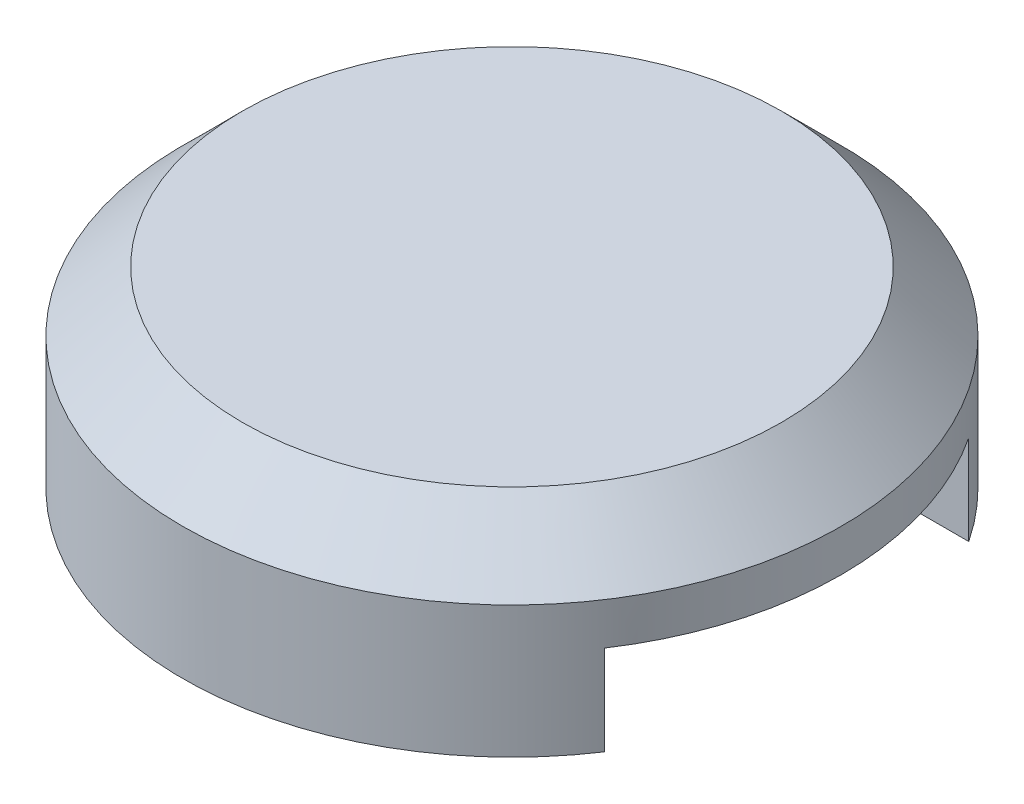
ISO-10303-21;
HEADER;
FILE_DESCRIPTION(('STEP AP214'),'2;1');
FILE_NAME('part.step','',(''),(''),'','','');
FILE_SCHEMA(('AUTOMOTIVE_DESIGN { 1 0 10303 214 1 1 1 1 }'));
ENDSEC;
DATA;
#1=APPLICATION_CONTEXT('core data for automotive mechanical design processes');
#2=APPLICATION_PROTOCOL_DEFINITION('international standard','automotive_design',2000,#1);
#3=PRODUCT_CONTEXT('',#1,'mechanical');
#4=PRODUCT('Part','Part','',(#3));
#5=PRODUCT_RELATED_PRODUCT_CATEGORY('part','',(#4));
#6=PRODUCT_DEFINITION_FORMATION('','',#4);
#7=PRODUCT_DEFINITION_CONTEXT('part definition',#1,'design');
#8=PRODUCT_DEFINITION('design','',#6,#7);
#9=PRODUCT_DEFINITION_SHAPE('','',#8);
#10=(LENGTH_UNIT() NAMED_UNIT(*) SI_UNIT(.MILLI.,.METRE.));
#11=(NAMED_UNIT(*) PLANE_ANGLE_UNIT() SI_UNIT($,.RADIAN.));
#12=(NAMED_UNIT(*) SI_UNIT($,.STERADIAN.) SOLID_ANGLE_UNIT());
#13=UNCERTAINTY_MEASURE_WITH_UNIT(LENGTH_MEASURE(1.E-05),#10,'distance_accuracy_value','');
#14=(GEOMETRIC_REPRESENTATION_CONTEXT(3) GLOBAL_UNCERTAINTY_ASSIGNED_CONTEXT((#13)) GLOBAL_UNIT_ASSIGNED_CONTEXT((#10,
#11,#12)) REPRESENTATION_CONTEXT('',''));
#15=CARTESIAN_POINT('',(0.,0.,0.));
#16=DIRECTION('',(0.,0.,1.));
#17=DIRECTION('',(1.,0.,0.));
#18=AXIS2_PLACEMENT_3D('',#15,#16,#17);
#19=CARTESIAN_POINT('',(0.,3.2,0.));
#20=DIRECTION('',(0.,-1.,0.));
#21=DIRECTION('',(0.,0.,-1.));
#22=AXIS2_PLACEMENT_3D('',#19,#20,#21);
#23=CYLINDRICAL_SURFACE('',#22,5.5);
#24=CARTESIAN_POINT('',(0.,2.19999999999999,0.));
#25=DIRECTION('',(0.,1.,0.));
#26=DIRECTION('',(0.,0.,1.));
#27=AXIS2_PLACEMENT_3D('',#24,#25,#26);
#28=CIRCLE('',#27,5.5);
#29=CARTESIAN_POINT('',(0.,2.19999999999999,5.5));
#30=VERTEX_POINT('',#29);
#31=EDGE_CURVE('E55',#30,#30,#28,.F.);
#32=ORIENTED_EDGE('',*,*,#31,.T.);
#33=EDGE_LOOP('',(#32));
#34=FACE_BOUND('',#33,.T.);
#35=CARTESIAN_POINT('',(0.,1.5,0.));
#36=DIRECTION('',(0.,1.,0.));
#37=DIRECTION('',(0.,0.,1.));
#38=AXIS2_PLACEMENT_3D('',#35,#36,#37);
#39=CIRCLE('',#38,5.5);
#40=CARTESIAN_POINT('',(4.5831212072124,1.5,3.04055915910216));
#41=VERTEX_POINT('',#40);
#42=CARTESIAN_POINT('',(4.5831212072124,1.5,-3.04055915910215));
#43=VERTEX_POINT('',#42);
#44=EDGE_CURVE('E69',#41,#43,#39,.T.);
#45=ORIENTED_EDGE('',*,*,#44,.T.);
#46=DIRECTION('',(0.,-1.,0.));
#47=VECTOR('',#46,1.);
#48=CARTESIAN_POINT('',(4.5831212072124,3.2,-3.04055915910215));
#49=LINE('',#48,#47);
#50=CARTESIAN_POINT('',(4.5831212072124,0.,-3.04055915910215));
#51=VERTEX_POINT('',#50);
#52=EDGE_CURVE('E97',#43,#51,#49,.T.);
#53=ORIENTED_EDGE('',*,*,#52,.T.);
#54=CARTESIAN_POINT('',(0.,0.,0.));
#55=DIRECTION('',(0.,1.,0.));
#56=DIRECTION('',(0.,0.,1.));
#57=AXIS2_PLACEMENT_3D('',#54,#55,#56);
#58=CIRCLE('',#57,5.5);
#59=CARTESIAN_POINT('',(4.5831212072124,0.,3.04055915910216));
#60=VERTEX_POINT('',#59);
#61=EDGE_CURVE('E125',#51,#60,#58,.T.);
#62=ORIENTED_EDGE('',*,*,#61,.T.);
#63=DIRECTION('',(0.,-1.,0.));
#64=VECTOR('',#63,1.);
#65=CARTESIAN_POINT('',(4.5831212072124,3.2,3.04055915910216));
#66=LINE('',#65,#64);
#67=EDGE_CURVE('E110',#60,#41,#66,.F.);
#68=ORIENTED_EDGE('',*,*,#67,.T.);
#69=EDGE_LOOP('',(#45,#53,#62,#68));
#70=FACE_BOUND('',#69,.T.);
#71=ADVANCED_FACE('F45',(#34,#70),#23,.T.);
#72=CARTESIAN_POINT('',(0.,3.2,0.));
#73=DIRECTION('',(0.,1.,0.));
#74=DIRECTION('',(0.,0.,1.));
#75=AXIS2_PLACEMENT_3D('',#72,#73,#74);
#76=PLANE('',#75);
#77=CARTESIAN_POINT('',(0.,3.2,0.));
#78=DIRECTION('',(0.,1.,0.));
#79=DIRECTION('',(0.,0.,1.));
#80=AXIS2_PLACEMENT_3D('',#77,#78,#79);
#81=CIRCLE('',#80,4.5);
#82=CARTESIAN_POINT('',(0.,3.2,4.5));
#83=VERTEX_POINT('',#82);
#84=EDGE_CURVE('E135',#83,#83,#81,.T.);
#85=ORIENTED_EDGE('',*,*,#84,.T.);
#86=EDGE_LOOP('',(#85));
#87=FACE_BOUND('',#86,.T.);
#88=ADVANCED_FACE('F149',(#87),#76,.T.);
#89=CARTESIAN_POINT('',(0.,0.,0.));
#90=DIRECTION('',(0.,1.,0.));
#91=DIRECTION('',(0.,0.,1.));
#92=AXIS2_PLACEMENT_3D('',#89,#90,#91);
#93=PLANE('',#92);
#94=ORIENTED_EDGE('',*,*,#61,.F.);
#95=DIRECTION('',(1.,0.,0.));
#96=VECTOR('',#95,1.);
#97=CARTESIAN_POINT('',(3.04055915910216,0.,-3.04055915910215));
#98=LINE('',#97,#96);
#99=CARTESIAN_POINT('',(3.04055915910216,0.,-3.04055915910215));
#100=VERTEX_POINT('',#99);
#101=EDGE_CURVE('E256',#100,#51,#98,.T.);
#102=ORIENTED_EDGE('',*,*,#101,.F.);
#103=CARTESIAN_POINT('',(0.,0.,0.));
#104=DIRECTION('',(0.,1.,0.));
#105=DIRECTION('',(0.,0.,1.));
#106=AXIS2_PLACEMENT_3D('',#103,#104,#105);
#107=CIRCLE('',#106,4.3);
#108=CARTESIAN_POINT('',(3.04055915910216,0.,3.04055915910216));
#109=VERTEX_POINT('',#108);
#110=EDGE_CURVE('E105',#100,#109,#107,.T.);
#111=ORIENTED_EDGE('',*,*,#110,.T.);
#112=DIRECTION('',(-1.,0.,0.));
#113=VECTOR('',#112,1.);
#114=CARTESIAN_POINT('',(3.04055915910216,0.,3.04055915910216));
#115=LINE('',#114,#113);
#116=EDGE_CURVE('E99',#60,#109,#115,.T.);
#117=ORIENTED_EDGE('',*,*,#116,.F.);
#118=EDGE_LOOP('',(#94,#102,#111,#117));
#119=FACE_BOUND('',#118,.T.);
#120=ADVANCED_FACE('F146',(#119),#93,.F.);
#121=CARTESIAN_POINT('',(0.,3.2,0.));
#122=DIRECTION('',(0.,-1.,0.));
#123=DIRECTION('',(0.,0.,-1.));
#124=AXIS2_PLACEMENT_3D('',#121,#122,#123);
#125=CONICAL_SURFACE('',#124,4.5,0.785398163397445);
#126=ORIENTED_EDGE('',*,*,#31,.F.);
#127=EDGE_LOOP('',(#126));
#128=FACE_BOUND('',#127,.T.);
#129=ORIENTED_EDGE('',*,*,#84,.F.);
#130=EDGE_LOOP('',(#129));
#131=FACE_BOUND('',#130,.T.);
#132=ADVANCED_FACE('F48',(#128,#131),#125,.T.);
#133=CARTESIAN_POINT('',(0.,3.2,0.));
#134=DIRECTION('',(0.,-1.,0.));
#135=DIRECTION('',(0.,0.,-1.));
#136=AXIS2_PLACEMENT_3D('',#133,#134,#135);
#137=CYLINDRICAL_SURFACE('',#136,4.3);
#138=DIRECTION('',(0.,-1.,0.));
#139=VECTOR('',#138,1.);
#140=CARTESIAN_POINT('',(3.04055915910216,1.5,-3.04055915910215));
#141=LINE('',#140,#139);
#142=CARTESIAN_POINT('',(3.04055915910216,1.5,-3.04055915910215));
#143=VERTEX_POINT('',#142);
#144=EDGE_CURVE('E94',#143,#100,#141,.T.);
#145=ORIENTED_EDGE('',*,*,#144,.F.);
#146=CARTESIAN_POINT('',(0.,1.5,0.));
#147=DIRECTION('',(0.,1.,0.));
#148=DIRECTION('',(0.,0.,1.));
#149=AXIS2_PLACEMENT_3D('',#146,#147,#148);
#150=CIRCLE('',#149,4.3);
#151=CARTESIAN_POINT('',(3.04055915910215,1.5,3.04055915910216));
#152=VERTEX_POINT('',#151);
#153=EDGE_CURVE('E11',#152,#143,#150,.T.);
#154=ORIENTED_EDGE('',*,*,#153,.F.);
#155=DIRECTION('',(0.,-1.,0.));
#156=VECTOR('',#155,1.);
#157=CARTESIAN_POINT('',(3.04055915910216,1.5,3.04055915910216));
#158=LINE('',#157,#156);
#159=EDGE_CURVE('E62',#152,#109,#158,.T.);
#160=ORIENTED_EDGE('',*,*,#159,.T.);
#161=ORIENTED_EDGE('',*,*,#110,.F.);
#162=EDGE_LOOP('',(#145,#154,#160,#161));
#163=FACE_BOUND('',#162,.T.);
#164=CARTESIAN_POINT('',(0.,1.70294372515228,0.));
#165=DIRECTION('',(0.,-1.,0.));
#166=DIRECTION('',(0.,0.,-1.));
#167=AXIS2_PLACEMENT_3D('',#164,#165,#166);
#168=CIRCLE('',#167,4.3);
#169=CARTESIAN_POINT('',(0.,1.70294372515228,-4.3));
#170=VERTEX_POINT('',#169);
#171=EDGE_CURVE('E121',#170,#170,#168,.T.);
#172=ORIENTED_EDGE('',*,*,#171,.F.);
#173=EDGE_LOOP('',(#172));
#174=FACE_BOUND('',#173,.T.);
#175=ADVANCED_FACE('F102',(#163,#174),#137,.F.);
#176=CARTESIAN_POINT('',(0.,2.,0.));
#177=DIRECTION('',(0.,1.,0.));
#178=DIRECTION('',(0.,0.,1.));
#179=AXIS2_PLACEMENT_3D('',#176,#177,#178);
#180=PLANE('',#179);
#181=CARTESIAN_POINT('',(0.,2.,0.));
#182=DIRECTION('',(0.,1.,0.));
#183=DIRECTION('',(0.,0.,1.));
#184=AXIS2_PLACEMENT_3D('',#181,#182,#183);
#185=CIRCLE('',#184,4.00294372515229);
#186=CARTESIAN_POINT('',(0.,2.,4.00294372515229));
#187=VERTEX_POINT('',#186);
#188=EDGE_CURVE('E126',#187,#187,#185,.T.);
#189=ORIENTED_EDGE('',*,*,#188,.F.);
#190=EDGE_LOOP('',(#189));
#191=FACE_BOUND('',#190,.T.);
#192=ADVANCED_FACE('F162',(#191),#180,.F.);
#193=CARTESIAN_POINT('',(0.,2.35147186257615,0.));
#194=DIRECTION('',(0.,-1.,0.));
#195=DIRECTION('',(0.,0.,-1.));
#196=AXIS2_PLACEMENT_3D('',#193,#194,#195);
#197=CONICAL_SURFACE('',#196,3.65147186257614,0.785398163397445);
#198=ORIENTED_EDGE('',*,*,#171,.T.);
#199=EDGE_LOOP('',(#198));
#200=FACE_BOUND('',#199,.T.);
#201=ORIENTED_EDGE('',*,*,#188,.T.);
#202=EDGE_LOOP('',(#201));
#203=FACE_BOUND('',#202,.T.);
#204=ADVANCED_FACE('F159',(#200,#203),#197,.F.);
#205=CARTESIAN_POINT('',(3.04055915910216,1.5,-3.04055915910215));
#206=DIRECTION('',(0.,0.,-1.));
#207=DIRECTION('',(-1.,0.,0.));
#208=AXIS2_PLACEMENT_3D('',#205,#206,#207);
#209=PLANE('',#208);
#210=DIRECTION('',(1.,0.,0.));
#211=VECTOR('',#210,1.);
#212=CARTESIAN_POINT('',(3.04055915910216,1.5,-3.04055915910215));
#213=LINE('',#212,#211);
#214=EDGE_CURVE('E88',#143,#43,#213,.T.);
#215=ORIENTED_EDGE('',*,*,#214,.F.);
#216=ORIENTED_EDGE('',*,*,#144,.T.);
#217=ORIENTED_EDGE('',*,*,#101,.T.);
#218=ORIENTED_EDGE('',*,*,#52,.F.);
#219=EDGE_LOOP('',(#215,#216,#217,#218));
#220=FACE_BOUND('',#219,.T.);
#221=ADVANCED_FACE('F93',(#220),#209,.F.);
#222=CARTESIAN_POINT('',(3.04055915910216,1.5,3.04055915910216));
#223=DIRECTION('',(0.,0.,1.));
#224=DIRECTION('',(1.,0.,0.));
#225=AXIS2_PLACEMENT_3D('',#222,#223,#224);
#226=PLANE('',#225);
#227=ORIENTED_EDGE('',*,*,#116,.T.);
#228=ORIENTED_EDGE('',*,*,#159,.F.);
#229=DIRECTION('',(-1.,0.,0.));
#230=VECTOR('',#229,1.);
#231=CARTESIAN_POINT('',(3.04055915910216,1.5,3.04055915910216));
#232=LINE('',#231,#230);
#233=EDGE_CURVE('E89',#41,#152,#232,.T.);
#234=ORIENTED_EDGE('',*,*,#233,.F.);
#235=ORIENTED_EDGE('',*,*,#67,.F.);
#236=EDGE_LOOP('',(#227,#228,#234,#235));
#237=FACE_BOUND('',#236,.T.);
#238=ADVANCED_FACE('F171',(#237),#226,.F.);
#239=CARTESIAN_POINT('',(0.,1.5,0.));
#240=DIRECTION('',(0.,1.,0.));
#241=DIRECTION('',(0.,0.,1.));
#242=AXIS2_PLACEMENT_3D('',#239,#240,#241);
#243=PLANE('',#242);
#244=ORIENTED_EDGE('',*,*,#233,.T.);
#245=ORIENTED_EDGE('',*,*,#153,.T.);
#246=ORIENTED_EDGE('',*,*,#214,.T.);
#247=ORIENTED_EDGE('',*,*,#44,.F.);
#248=EDGE_LOOP('',(#244,#245,#246,#247));
#249=FACE_BOUND('',#248,.T.);
#250=ADVANCED_FACE('F87',(#249),#243,.F.);
#251=CLOSED_SHELL('',(#71,#88,#120,#132,#175,#192,#204,#221,#238,#250));
#252=MANIFOLD_SOLID_BREP('B2',#251);
#253=ADVANCED_BREP_SHAPE_REPRESENTATION('',(#18,#252),#14);
#254=SHAPE_DEFINITION_REPRESENTATION(#9,#253);
ENDSEC;
END-ISO-10303-21;
